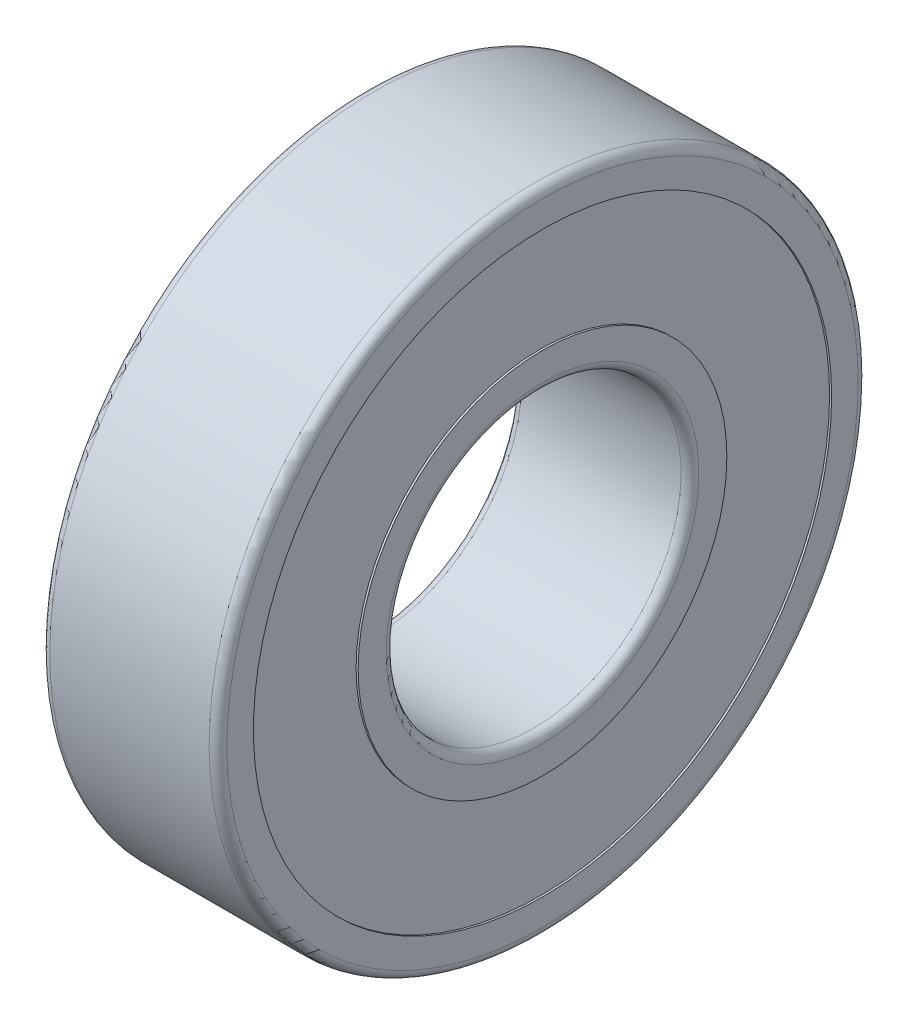
ISO-10303-21;
HEADER;
FILE_DESCRIPTION(('STEP AP214'),'2;1');
FILE_NAME('part.step','',(''),(''),'','','');
FILE_SCHEMA(('AUTOMOTIVE_DESIGN { 1 0 10303 214 1 1 1 1 }'));
ENDSEC;
DATA;
#1=APPLICATION_CONTEXT('core data for automotive mechanical design processes');
#2=APPLICATION_PROTOCOL_DEFINITION('international standard','automotive_design',2000,#1);
#3=PRODUCT_CONTEXT('',#1,'mechanical');
#4=PRODUCT('Part','Part','',(#3));
#5=PRODUCT_RELATED_PRODUCT_CATEGORY('part','',(#4));
#6=PRODUCT_DEFINITION_FORMATION('','',#4);
#7=PRODUCT_DEFINITION_CONTEXT('part definition',#1,'design');
#8=PRODUCT_DEFINITION('design','',#6,#7);
#9=PRODUCT_DEFINITION_SHAPE('','',#8);
#10=(LENGTH_UNIT() NAMED_UNIT(*) SI_UNIT(.MILLI.,.METRE.));
#11=(NAMED_UNIT(*) PLANE_ANGLE_UNIT() SI_UNIT($,.RADIAN.));
#12=(NAMED_UNIT(*) SI_UNIT($,.STERADIAN.) SOLID_ANGLE_UNIT());
#13=UNCERTAINTY_MEASURE_WITH_UNIT(LENGTH_MEASURE(1.E-05),#10,'distance_accuracy_value','');
#14=(GEOMETRIC_REPRESENTATION_CONTEXT(3) GLOBAL_UNCERTAINTY_ASSIGNED_CONTEXT((#13)) GLOBAL_UNIT_ASSIGNED_CONTEXT((#10,
#11,#12)) REPRESENTATION_CONTEXT('',''));
#15=CARTESIAN_POINT('',(0.,0.,0.));
#16=DIRECTION('',(0.,0.,1.));
#17=DIRECTION('',(1.,0.,0.));
#18=AXIS2_PLACEMENT_3D('',#15,#16,#17);
#19=CARTESIAN_POINT('',(3.,-3.71778537635,-7.083648205226));
#20=DIRECTION('',(-1.,0.,0.));
#21=DIRECTION('',(0.,0.,-1.));
#22=AXIS2_PLACEMENT_3D('',#19,#20,#21);
#23=SPHERICAL_SURFACE('',#22,1.5);
#24=CARTESIAN_POINT('',(4.5,-3.71778537635,-7.083648205226));
#25=VERTEX_POINT('',#24);
#26=VERTEX_LOOP('',#25);
#27=FACE_BOUND('',#26,.T.);
#28=ADVANCED_FACE('P0_F15',(#27),#23,.T.);
#29=CLOSED_SHELL('',(#28));
#30=MANIFOLD_SOLID_BREP('P0_B1',#29);
#31=CARTESIAN_POINT('',(3.,7.941670992784,-0.964293442043));
#32=DIRECTION('',(-1.,0.,0.));
#33=DIRECTION('',(0.,0.,-1.));
#34=AXIS2_PLACEMENT_3D('',#31,#32,#33);
#35=SPHERICAL_SURFACE('',#34,1.5);
#36=CARTESIAN_POINT('',(4.5,7.941670992784,-0.964293442043));
#37=VERTEX_POINT('',#36);
#38=VERTEX_LOOP('',#37);
#39=FACE_BOUND('',#38,.T.);
#40=ADVANCED_FACE('P1_F15',(#39),#35,.T.);
#41=CLOSED_SHELL('',(#40));
#42=MANIFOLD_SOLID_BREP('P1_B1',#41);
#43=CARTESIAN_POINT('',(3.,6.583870927149,-4.544517973849));
#44=DIRECTION('',(-1.,0.,0.));
#45=DIRECTION('',(0.,0.,-1.));
#46=AXIS2_PLACEMENT_3D('',#43,#44,#45);
#47=SPHERICAL_SURFACE('',#46,1.5);
#48=CARTESIAN_POINT('',(4.5,6.583870927149,-4.544517973849));
#49=VERTEX_POINT('',#48);
#50=VERTEX_LOOP('',#49);
#51=FACE_BOUND('',#50,.T.);
#52=ADVANCED_FACE('P2_F15',(#51),#47,.T.);
#53=CLOSED_SHELL('',(#52));
#54=MANIFOLD_SOLID_BREP('P2_B1',#53);
#55=CARTESIAN_POINT('',(3.,3.71778537635,-7.083648205226));
#56=DIRECTION('',(-1.,0.,0.));
#57=DIRECTION('',(0.,0.,-1.));
#58=AXIS2_PLACEMENT_3D('',#55,#56,#57);
#59=SPHERICAL_SURFACE('',#58,1.5);
#60=CARTESIAN_POINT('',(4.5,3.71778537635,-7.083648205226));
#61=VERTEX_POINT('',#60);
#62=VERTEX_LOOP('',#61);
#63=FACE_BOUND('',#62,.T.);
#64=ADVANCED_FACE('P3_F15',(#63),#59,.T.);
#65=CLOSED_SHELL('',(#64));
#66=MANIFOLD_SOLID_BREP('P3_B1',#65);
#67=CARTESIAN_POINT('',(3.,0.,-8.));
#68=DIRECTION('',(-1.,0.,0.));
#69=DIRECTION('',(0.,0.,-1.));
#70=AXIS2_PLACEMENT_3D('',#67,#68,#69);
#71=SPHERICAL_SURFACE('',#70,1.5);
#72=CARTESIAN_POINT('',(4.5,0.,-8.));
#73=VERTEX_POINT('',#72);
#74=VERTEX_LOOP('',#73);
#75=FACE_BOUND('',#74,.T.);
#76=ADVANCED_FACE('P4_F15',(#75),#71,.T.);
#77=CLOSED_SHELL('',(#76));
#78=MANIFOLD_SOLID_BREP('P4_B1',#77);
#79=CARTESIAN_POINT('',(3.,-6.583870927149,-4.544517973849));
#80=DIRECTION('',(-1.,0.,0.));
#81=DIRECTION('',(0.,0.,-1.));
#82=AXIS2_PLACEMENT_3D('',#79,#80,#81);
#83=SPHERICAL_SURFACE('',#82,1.5);
#84=CARTESIAN_POINT('',(4.5,-6.583870927149,-4.544517973849));
#85=VERTEX_POINT('',#84);
#86=VERTEX_LOOP('',#85);
#87=FACE_BOUND('',#86,.T.);
#88=ADVANCED_FACE('P5_F15',(#87),#83,.T.);
#89=CLOSED_SHELL('',(#88));
#90=MANIFOLD_SOLID_BREP('P5_B1',#89);
#91=CARTESIAN_POINT('',(3.,-7.941670992784,-0.964293442043));
#92=DIRECTION('',(-1.,0.,0.));
#93=DIRECTION('',(0.,0.,-1.));
#94=AXIS2_PLACEMENT_3D('',#91,#92,#93);
#95=SPHERICAL_SURFACE('',#94,1.5);
#96=CARTESIAN_POINT('',(4.5,-7.941670992784,-0.964293442043));
#97=VERTEX_POINT('',#96);
#98=VERTEX_LOOP('',#97);
#99=FACE_BOUND('',#98,.T.);
#100=ADVANCED_FACE('P6_F15',(#99),#95,.T.);
#101=CLOSED_SHELL('',(#100));
#102=MANIFOLD_SOLID_BREP('P6_B1',#101);
#103=CARTESIAN_POINT('',(3.,-7.480129941483,2.83683909634));
#104=DIRECTION('',(-1.,0.,0.));
#105=DIRECTION('',(0.,0.,-1.));
#106=AXIS2_PLACEMENT_3D('',#103,#104,#105);
#107=SPHERICAL_SURFACE('',#106,1.5);
#108=CARTESIAN_POINT('',(4.5,-7.480129941483,2.83683909634));
#109=VERTEX_POINT('',#108);
#110=VERTEX_LOOP('',#109);
#111=FACE_BOUND('',#110,.T.);
#112=ADVANCED_FACE('P7_F15',(#111),#107,.T.);
#113=CLOSED_SHELL('',(#112));
#114=MANIFOLD_SOLID_BREP('P7_B1',#113);
#115=CARTESIAN_POINT('',(3.,-5.304981265926,5.988085985369));
#116=DIRECTION('',(-1.,0.,0.));
#117=DIRECTION('',(0.,0.,-1.));
#118=AXIS2_PLACEMENT_3D('',#115,#116,#117);
#119=SPHERICAL_SURFACE('',#118,1.5);
#120=CARTESIAN_POINT('',(4.5,-5.304981265926,5.988085985369));
#121=VERTEX_POINT('',#120);
#122=VERTEX_LOOP('',#121);
#123=FACE_BOUND('',#122,.T.);
#124=ADVANCED_FACE('P8_F15',(#123),#119,.T.);
#125=CLOSED_SHELL('',(#124));
#126=MANIFOLD_SOLID_BREP('P8_B1',#125);
#127=CARTESIAN_POINT('',(3.,-1.9145253143,7.767534539408));
#128=DIRECTION('',(-1.,0.,0.));
#129=DIRECTION('',(0.,0.,-1.));
#130=AXIS2_PLACEMENT_3D('',#127,#128,#129);
#131=SPHERICAL_SURFACE('',#130,1.5);
#132=CARTESIAN_POINT('',(4.5,-1.9145253143,7.767534539408));
#133=VERTEX_POINT('',#132);
#134=VERTEX_LOOP('',#133);
#135=FACE_BOUND('',#134,.T.);
#136=ADVANCED_FACE('P9_F15',(#135),#131,.T.);
#137=CLOSED_SHELL('',(#136));
#138=MANIFOLD_SOLID_BREP('P9_B1',#137);
#139=CARTESIAN_POINT('',(3.,1.9145253143,7.767534539408));
#140=DIRECTION('',(-1.,0.,0.));
#141=DIRECTION('',(0.,0.,-1.));
#142=AXIS2_PLACEMENT_3D('',#139,#140,#141);
#143=SPHERICAL_SURFACE('',#142,1.5);
#144=CARTESIAN_POINT('',(4.5,1.9145253143,7.767534539408));
#145=VERTEX_POINT('',#144);
#146=VERTEX_LOOP('',#145);
#147=FACE_BOUND('',#146,.T.);
#148=ADVANCED_FACE('P10_F15',(#147),#143,.T.);
#149=CLOSED_SHELL('',(#148));
#150=MANIFOLD_SOLID_BREP('P10_B1',#149);
#151=CARTESIAN_POINT('',(3.,5.304981265926,5.988085985369));
#152=DIRECTION('',(-1.,0.,0.));
#153=DIRECTION('',(0.,0.,-1.));
#154=AXIS2_PLACEMENT_3D('',#151,#152,#153);
#155=SPHERICAL_SURFACE('',#154,1.5);
#156=CARTESIAN_POINT('',(4.5,5.304981265926,5.988085985369));
#157=VERTEX_POINT('',#156);
#158=VERTEX_LOOP('',#157);
#159=FACE_BOUND('',#158,.T.);
#160=ADVANCED_FACE('P11_F15',(#159),#155,.T.);
#161=CLOSED_SHELL('',(#160));
#162=MANIFOLD_SOLID_BREP('P11_B1',#161);
#163=CARTESIAN_POINT('',(3.,7.480129941483,2.83683909634));
#164=DIRECTION('',(-1.,0.,0.));
#165=DIRECTION('',(0.,0.,-1.));
#166=AXIS2_PLACEMENT_3D('',#163,#164,#165);
#167=SPHERICAL_SURFACE('',#166,1.5);
#168=CARTESIAN_POINT('',(4.5,7.480129941483,2.83683909634));
#169=VERTEX_POINT('',#168);
#170=VERTEX_LOOP('',#169);
#171=FACE_BOUND('',#170,.T.);
#172=ADVANCED_FACE('P12_F15',(#171),#167,.T.);
#173=CLOSED_SHELL('',(#172));
#174=MANIFOLD_SOLID_BREP('P12_B1',#173);
#175=CARTESIAN_POINT('',(6.,0.,0.));
#176=DIRECTION('',(1.,0.,0.));
#177=DIRECTION('',(0.,-1.,0.));
#178=AXIS2_PLACEMENT_3D('',#175,#176,#177);
#179=CYLINDRICAL_SURFACE('',#178,6.25);
#180=CARTESIAN_POINT('',(0.276,0.,0.));
#181=DIRECTION('',(1.,0.,0.));
#182=DIRECTION('',(0.,-1.,0.));
#183=AXIS2_PLACEMENT_3D('',#180,#181,#182);
#184=CIRCLE('',#183,6.25);
#185=CARTESIAN_POINT('',(0.276,-6.25,0.));
#186=VERTEX_POINT('',#185);
#187=EDGE_CURVE('P13_E11',#186,#186,#184,.T.);
#188=ORIENTED_EDGE('',*,*,#187,.F.);
#189=EDGE_LOOP('',(#188));
#190=FACE_BOUND('',#189,.T.);
#191=CARTESIAN_POINT('',(0.,0.,0.));
#192=DIRECTION('',(1.,0.,0.));
#193=DIRECTION('',(0.,-1.,0.));
#194=AXIS2_PLACEMENT_3D('',#191,#192,#193);
#195=CIRCLE('',#194,6.25);
#196=CARTESIAN_POINT('',(0.,-6.25,0.));
#197=VERTEX_POINT('',#196);
#198=EDGE_CURVE('P13_E70',#197,#197,#195,.T.);
#199=ORIENTED_EDGE('',*,*,#198,.T.);
#200=EDGE_LOOP('',(#199));
#201=FACE_BOUND('',#200,.T.);
#202=ADVANCED_FACE('P13_F17',(#190,#201),#179,.T.);
#203=CARTESIAN_POINT('',(0.276,0.,-6.855));
#204=DIRECTION('',(-1.,0.,0.));
#205=DIRECTION('',(0.,1.,0.));
#206=AXIS2_PLACEMENT_3D('',#203,#204,#205);
#207=PLANE('',#206);
#208=CARTESIAN_POINT('',(0.276,0.,0.));
#209=DIRECTION('',(1.,0.,0.));
#210=DIRECTION('',(0.,-1.,0.));
#211=AXIS2_PLACEMENT_3D('',#208,#209,#210);
#212=CIRCLE('',#211,6.855);
#213=CARTESIAN_POINT('',(0.276,-6.855,0.));
#214=VERTEX_POINT('',#213);
#215=EDGE_CURVE('P13_E28',#214,#214,#212,.T.);
#216=ORIENTED_EDGE('',*,*,#215,.F.);
#217=EDGE_LOOP('',(#216));
#218=FACE_BOUND('',#217,.T.);
#219=ORIENTED_EDGE('',*,*,#187,.T.);
#220=EDGE_LOOP('',(#219));
#221=FACE_BOUND('',#220,.T.);
#222=ADVANCED_FACE('P13_F186',(#218,#221),#207,.T.);
#223=CARTESIAN_POINT('',(6.,0.,0.));
#224=DIRECTION('',(1.,0.,0.));
#225=DIRECTION('',(0.,-1.,0.));
#226=AXIS2_PLACEMENT_3D('',#223,#224,#225);
#227=CYLINDRICAL_SURFACE('',#226,6.855);
#228=CARTESIAN_POINT('',(2.03099277608472,0.,0.));
#229=DIRECTION('',(1.,0.,0.));
#230=DIRECTION('',(0.,-1.,0.));
#231=AXIS2_PLACEMENT_3D('',#228,#229,#230);
#232=CIRCLE('',#231,6.855);
#233=CARTESIAN_POINT('',(2.03099277608472,-6.855,0.));
#234=VERTEX_POINT('',#233);
#235=EDGE_CURVE('P13_E100',#234,#234,#232,.T.);
#236=ORIENTED_EDGE('',*,*,#235,.F.);
#237=EDGE_LOOP('',(#236));
#238=FACE_BOUND('',#237,.T.);
#239=ORIENTED_EDGE('',*,*,#215,.T.);
#240=EDGE_LOOP('',(#239));
#241=FACE_BOUND('',#240,.T.);
#242=ADVANCED_FACE('P13_F19',(#238,#241),#227,.T.);
#243=CARTESIAN_POINT('',(3.,0.,0.));
#244=DIRECTION('',(1.,0.,0.));
#245=DIRECTION('',(0.,-1.,0.));
#246=AXIS2_PLACEMENT_3D('',#243,#244,#245);
#247=TOROIDAL_SURFACE('',#246,8.,1.5);
#248=ORIENTED_EDGE('',*,*,#235,.T.);
#249=EDGE_LOOP('',(#248));
#250=FACE_BOUND('',#249,.T.);
#251=CARTESIAN_POINT('',(3.96900722391528,0.,0.));
#252=DIRECTION('',(1.,0.,0.));
#253=DIRECTION('',(0.,-1.,0.));
#254=AXIS2_PLACEMENT_3D('',#251,#252,#253);
#255=CIRCLE('',#254,6.855);
#256=CARTESIAN_POINT('',(3.96900722391528,-6.855,0.));
#257=VERTEX_POINT('',#256);
#258=EDGE_CURVE('P13_E21',#257,#257,#255,.T.);
#259=ORIENTED_EDGE('',*,*,#258,.F.);
#260=EDGE_LOOP('',(#259));
#261=FACE_BOUND('',#260,.T.);
#262=ADVANCED_FACE('P13_F230',(#250,#261),#247,.F.);
#263=CARTESIAN_POINT('',(6.,0.,0.));
#264=DIRECTION('',(1.,0.,0.));
#265=DIRECTION('',(0.,-1.,0.));
#266=AXIS2_PLACEMENT_3D('',#263,#264,#265);
#267=CYLINDRICAL_SURFACE('',#266,6.855);
#268=CARTESIAN_POINT('',(5.724,0.,0.));
#269=DIRECTION('',(1.,0.,0.));
#270=DIRECTION('',(0.,-1.,0.));
#271=AXIS2_PLACEMENT_3D('',#268,#269,#270);
#272=CIRCLE('',#271,6.855);
#273=CARTESIAN_POINT('',(5.724,-6.855,0.));
#274=VERTEX_POINT('',#273);
#275=EDGE_CURVE('P13_E92',#274,#274,#272,.T.);
#276=ORIENTED_EDGE('',*,*,#275,.F.);
#277=EDGE_LOOP('',(#276));
#278=FACE_BOUND('',#277,.T.);
#279=ORIENTED_EDGE('',*,*,#258,.T.);
#280=EDGE_LOOP('',(#279));
#281=FACE_BOUND('',#280,.T.);
#282=ADVANCED_FACE('P13_F97',(#278,#281),#267,.T.);
#283=CARTESIAN_POINT('',(5.724,0.,-6.25));
#284=DIRECTION('',(1.,0.,0.));
#285=DIRECTION('',(0.,0.,-1.));
#286=AXIS2_PLACEMENT_3D('',#283,#284,#285);
#287=PLANE('',#286);
#288=CARTESIAN_POINT('',(5.724,0.,0.));
#289=DIRECTION('',(1.,0.,0.));
#290=DIRECTION('',(0.,-1.,0.));
#291=AXIS2_PLACEMENT_3D('',#288,#289,#290);
#292=CIRCLE('',#291,6.25);
#293=CARTESIAN_POINT('',(5.724,-6.25,0.));
#294=VERTEX_POINT('',#293);
#295=EDGE_CURVE('P13_E107',#294,#294,#292,.T.);
#296=ORIENTED_EDGE('',*,*,#295,.F.);
#297=EDGE_LOOP('',(#296));
#298=FACE_BOUND('',#297,.T.);
#299=ORIENTED_EDGE('',*,*,#275,.T.);
#300=EDGE_LOOP('',(#299));
#301=FACE_BOUND('',#300,.T.);
#302=ADVANCED_FACE('P13_F152',(#298,#301),#287,.T.);
#303=CARTESIAN_POINT('',(6.,0.,0.));
#304=DIRECTION('',(1.,0.,0.));
#305=DIRECTION('',(0.,-1.,0.));
#306=AXIS2_PLACEMENT_3D('',#303,#304,#305);
#307=CYLINDRICAL_SURFACE('',#306,6.25);
#308=CARTESIAN_POINT('',(6.,0.,0.));
#309=DIRECTION('',(1.,0.,0.));
#310=DIRECTION('',(0.,-1.,0.));
#311=AXIS2_PLACEMENT_3D('',#308,#309,#310);
#312=CIRCLE('',#311,6.25);
#313=CARTESIAN_POINT('',(6.,-6.25,0.));
#314=VERTEX_POINT('',#313);
#315=EDGE_CURVE('P13_E112',#314,#314,#312,.T.);
#316=ORIENTED_EDGE('',*,*,#315,.F.);
#317=EDGE_LOOP('',(#316));
#318=FACE_BOUND('',#317,.T.);
#319=ORIENTED_EDGE('',*,*,#295,.T.);
#320=EDGE_LOOP('',(#319));
#321=FACE_BOUND('',#320,.T.);
#322=ADVANCED_FACE('P13_F157',(#318,#321),#307,.T.);
#323=CARTESIAN_POINT('',(6.,0.,-5.3));
#324=DIRECTION('',(1.,0.,0.));
#325=DIRECTION('',(0.,0.,-1.));
#326=AXIS2_PLACEMENT_3D('',#323,#324,#325);
#327=PLANE('',#326);
#328=CARTESIAN_POINT('',(6.,0.,0.));
#329=DIRECTION('',(1.,0.,0.));
#330=DIRECTION('',(0.,-1.,0.));
#331=AXIS2_PLACEMENT_3D('',#328,#329,#330);
#332=CIRCLE('',#331,5.3);
#333=CARTESIAN_POINT('',(6.,-5.3,0.));
#334=VERTEX_POINT('',#333);
#335=EDGE_CURVE('P13_E120',#334,#334,#332,.T.);
#336=ORIENTED_EDGE('',*,*,#335,.F.);
#337=EDGE_LOOP('',(#336));
#338=FACE_BOUND('',#337,.T.);
#339=ORIENTED_EDGE('',*,*,#315,.T.);
#340=EDGE_LOOP('',(#339));
#341=FACE_BOUND('',#340,.T.);
#342=ADVANCED_FACE('P13_F200',(#338,#341),#327,.T.);
#343=CARTESIAN_POINT('',(5.7,0.,0.));
#344=DIRECTION('',(1.,0.,0.));
#345=DIRECTION('',(0.,-1.,0.));
#346=AXIS2_PLACEMENT_3D('',#343,#344,#345);
#347=TOROIDAL_SURFACE('',#346,5.3,0.3);
#348=CARTESIAN_POINT('',(5.7,0.,0.));
#349=DIRECTION('',(1.,0.,0.));
#350=DIRECTION('',(0.,-1.,0.));
#351=AXIS2_PLACEMENT_3D('',#348,#349,#350);
#352=CIRCLE('',#351,5.);
#353=CARTESIAN_POINT('',(5.7,-5.,0.));
#354=VERTEX_POINT('',#353);
#355=EDGE_CURVE('P13_E119',#354,#354,#352,.T.);
#356=ORIENTED_EDGE('',*,*,#355,.F.);
#357=EDGE_LOOP('',(#356));
#358=FACE_BOUND('',#357,.T.);
#359=ORIENTED_EDGE('',*,*,#335,.T.);
#360=EDGE_LOOP('',(#359));
#361=FACE_BOUND('',#360,.T.);
#362=ADVANCED_FACE('P13_F180',(#358,#361),#347,.T.);
#363=CARTESIAN_POINT('',(6.,0.,0.));
#364=DIRECTION('',(1.,0.,0.));
#365=DIRECTION('',(0.,-1.,0.));
#366=AXIS2_PLACEMENT_3D('',#363,#364,#365);
#367=CYLINDRICAL_SURFACE('',#366,5.);
#368=CARTESIAN_POINT('',(0.3,0.,0.));
#369=DIRECTION('',(1.,0.,0.));
#370=DIRECTION('',(0.,-1.,0.));
#371=AXIS2_PLACEMENT_3D('',#368,#369,#370);
#372=CIRCLE('',#371,5.);
#373=CARTESIAN_POINT('',(0.3,-5.,0.));
#374=VERTEX_POINT('',#373);
#375=EDGE_CURVE('P13_E59',#374,#374,#372,.T.);
#376=ORIENTED_EDGE('',*,*,#375,.F.);
#377=EDGE_LOOP('',(#376));
#378=FACE_BOUND('',#377,.T.);
#379=ORIENTED_EDGE('',*,*,#355,.T.);
#380=EDGE_LOOP('',(#379));
#381=FACE_BOUND('',#380,.T.);
#382=ADVANCED_FACE('P13_F170',(#378,#381),#367,.F.);
#383=CARTESIAN_POINT('',(0.3,0.,0.));
#384=DIRECTION('',(1.,0.,0.));
#385=DIRECTION('',(0.,-1.,0.));
#386=AXIS2_PLACEMENT_3D('',#383,#384,#385);
#387=TOROIDAL_SURFACE('',#386,5.3,0.3);
#388=CARTESIAN_POINT('',(0.,0.,0.));
#389=DIRECTION('',(1.,0.,0.));
#390=DIRECTION('',(0.,-1.,0.));
#391=AXIS2_PLACEMENT_3D('',#388,#389,#390);
#392=CIRCLE('',#391,5.3);
#393=CARTESIAN_POINT('',(0.,-5.3,0.));
#394=VERTEX_POINT('',#393);
#395=EDGE_CURVE('P13_E78',#394,#394,#392,.T.);
#396=ORIENTED_EDGE('',*,*,#395,.F.);
#397=EDGE_LOOP('',(#396));
#398=FACE_BOUND('',#397,.T.);
#399=ORIENTED_EDGE('',*,*,#375,.T.);
#400=EDGE_LOOP('',(#399));
#401=FACE_BOUND('',#400,.T.);
#402=ADVANCED_FACE('P13_F164',(#398,#401),#387,.T.);
#403=CARTESIAN_POINT('',(0.,0.,-6.25));
#404=DIRECTION('',(-1.,0.,0.));
#405=DIRECTION('',(0.,1.,0.));
#406=AXIS2_PLACEMENT_3D('',#403,#404,#405);
#407=PLANE('',#406);
#408=ORIENTED_EDGE('',*,*,#198,.F.);
#409=EDGE_LOOP('',(#408));
#410=FACE_BOUND('',#409,.T.);
#411=ORIENTED_EDGE('',*,*,#395,.T.);
#412=EDGE_LOOP('',(#411));
#413=FACE_BOUND('',#412,.T.);
#414=ADVANCED_FACE('P13_F169',(#410,#413),#407,.T.);
#415=CLOSED_SHELL('',(#202,#222,#242,#262,#282,#302,#322,#342,#362,#382,#402,#414));
#416=MANIFOLD_SOLID_BREP('P13_B1',#415);
#417=CARTESIAN_POINT('',(0.3,0.,0.));
#418=DIRECTION('',(1.,0.,0.));
#419=DIRECTION('',(0.,0.,-1.));
#420=AXIS2_PLACEMENT_3D('',#417,#418,#419);
#421=TOROIDAL_SURFACE('',#420,10.7,0.3);
#422=CARTESIAN_POINT('',(0.3,0.,0.));
#423=DIRECTION('',(1.,0.,0.));
#424=DIRECTION('',(0.,0.,-1.));
#425=AXIS2_PLACEMENT_3D('',#422,#423,#424);
#426=CIRCLE('',#425,11.);
#427=CARTESIAN_POINT('',(0.3,0.,-11.));
#428=VERTEX_POINT('',#427);
#429=EDGE_CURVE('P14_E10',#428,#428,#426,.T.);
#430=ORIENTED_EDGE('',*,*,#429,.F.);
#431=EDGE_LOOP('',(#430));
#432=FACE_BOUND('',#431,.T.);
#433=CARTESIAN_POINT('',(0.,0.,0.));
#434=DIRECTION('',(1.,0.,0.));
#435=DIRECTION('',(0.,0.,-1.));
#436=AXIS2_PLACEMENT_3D('',#433,#434,#435);
#437=CIRCLE('',#436,10.7);
#438=CARTESIAN_POINT('',(0.,0.,-10.7));
#439=VERTEX_POINT('',#438);
#440=EDGE_CURVE('P14_E106',#439,#439,#437,.T.);
#441=ORIENTED_EDGE('',*,*,#440,.T.);
#442=EDGE_LOOP('',(#441));
#443=FACE_BOUND('',#442,.T.);
#444=ADVANCED_FACE('P14_F16',(#432,#443),#421,.T.);
#445=CARTESIAN_POINT('',(6.,0.,0.));
#446=DIRECTION('',(1.,0.,0.));
#447=DIRECTION('',(0.,0.,-1.));
#448=AXIS2_PLACEMENT_3D('',#445,#446,#447);
#449=CYLINDRICAL_SURFACE('',#448,11.);
#450=CARTESIAN_POINT('',(5.7,0.,0.));
#451=DIRECTION('',(1.,0.,0.));
#452=DIRECTION('',(0.,0.,-1.));
#453=AXIS2_PLACEMENT_3D('',#450,#451,#452);
#454=CIRCLE('',#453,11.);
#455=CARTESIAN_POINT('',(5.7,0.,-11.));
#456=VERTEX_POINT('',#455);
#457=EDGE_CURVE('P14_E26',#456,#456,#454,.T.);
#458=ORIENTED_EDGE('',*,*,#457,.F.);
#459=EDGE_LOOP('',(#458));
#460=FACE_BOUND('',#459,.T.);
#461=ORIENTED_EDGE('',*,*,#429,.T.);
#462=EDGE_LOOP('',(#461));
#463=FACE_BOUND('',#462,.T.);
#464=ADVANCED_FACE('P14_F251',(#460,#463),#449,.T.);
#465=CARTESIAN_POINT('',(5.7,0.,0.));
#466=DIRECTION('',(1.,0.,0.));
#467=DIRECTION('',(0.,0.,-1.));
#468=AXIS2_PLACEMENT_3D('',#465,#466,#467);
#469=TOROIDAL_SURFACE('',#468,10.7,0.3);
#470=CARTESIAN_POINT('',(6.,0.,0.));
#471=DIRECTION('',(1.,0.,0.));
#472=DIRECTION('',(0.,0.,-1.));
#473=AXIS2_PLACEMENT_3D('',#470,#471,#472);
#474=CIRCLE('',#473,10.7);
#475=CARTESIAN_POINT('',(6.,0.,-10.7));
#476=VERTEX_POINT('',#475);
#477=EDGE_CURVE('P14_E88',#476,#476,#474,.T.);
#478=ORIENTED_EDGE('',*,*,#477,.F.);
#479=EDGE_LOOP('',(#478));
#480=FACE_BOUND('',#479,.T.);
#481=ORIENTED_EDGE('',*,*,#457,.T.);
#482=EDGE_LOOP('',(#481));
#483=FACE_BOUND('',#482,.T.);
#484=ADVANCED_FACE('P14_F243',(#480,#483),#469,.T.);
#485=CARTESIAN_POINT('',(6.,9.8,0.));
#486=DIRECTION('',(1.,0.,0.));
#487=DIRECTION('',(0.,1.,0.));
#488=AXIS2_PLACEMENT_3D('',#485,#486,#487);
#489=PLANE('',#488);
#490=CARTESIAN_POINT('',(6.,0.,0.));
#491=DIRECTION('',(1.,0.,0.));
#492=DIRECTION('',(0.,0.,-1.));
#493=AXIS2_PLACEMENT_3D('',#490,#491,#492);
#494=CIRCLE('',#493,9.8);
#495=CARTESIAN_POINT('',(6.,0.,-9.8));
#496=VERTEX_POINT('',#495);
#497=EDGE_CURVE('P14_E84',#496,#496,#494,.T.);
#498=ORIENTED_EDGE('',*,*,#497,.F.);
#499=EDGE_LOOP('',(#498));
#500=FACE_BOUND('',#499,.T.);
#501=ORIENTED_EDGE('',*,*,#477,.T.);
#502=EDGE_LOOP('',(#501));
#503=FACE_BOUND('',#502,.T.);
#504=ADVANCED_FACE('P14_F233',(#500,#503),#489,.T.);
#505=CARTESIAN_POINT('',(6.,0.,0.));
#506=DIRECTION('',(1.,0.,0.));
#507=DIRECTION('',(0.,0.,-1.));
#508=AXIS2_PLACEMENT_3D('',#505,#506,#507);
#509=CYLINDRICAL_SURFACE('',#508,9.8);
#510=CARTESIAN_POINT('',(5.724,0.,0.));
#511=DIRECTION('',(1.,0.,0.));
#512=DIRECTION('',(0.,0.,-1.));
#513=AXIS2_PLACEMENT_3D('',#510,#511,#512);
#514=CIRCLE('',#513,9.8);
#515=CARTESIAN_POINT('',(5.724,0.,-9.8));
#516=VERTEX_POINT('',#515);
#517=EDGE_CURVE('P14_E89',#516,#516,#514,.T.);
#518=ORIENTED_EDGE('',*,*,#517,.F.);
#519=EDGE_LOOP('',(#518));
#520=FACE_BOUND('',#519,.T.);
#521=ORIENTED_EDGE('',*,*,#497,.T.);
#522=EDGE_LOOP('',(#521));
#523=FACE_BOUND('',#522,.T.);
#524=ADVANCED_FACE('P14_F85',(#520,#523),#509,.F.);
#525=CARTESIAN_POINT('',(5.724,9.175,0.));
#526=DIRECTION('',(1.,0.,0.));
#527=DIRECTION('',(0.,1.,0.));
#528=AXIS2_PLACEMENT_3D('',#525,#526,#527);
#529=PLANE('',#528);
#530=CARTESIAN_POINT('',(5.724,0.,0.));
#531=DIRECTION('',(1.,0.,0.));
#532=DIRECTION('',(0.,0.,-1.));
#533=AXIS2_PLACEMENT_3D('',#530,#531,#532);
#534=CIRCLE('',#533,9.175);
#535=CARTESIAN_POINT('',(5.724,0.,-9.175));
#536=VERTEX_POINT('',#535);
#537=EDGE_CURVE('P14_E96',#536,#536,#534,.T.);
#538=ORIENTED_EDGE('',*,*,#537,.F.);
#539=EDGE_LOOP('',(#538));
#540=FACE_BOUND('',#539,.T.);
#541=ORIENTED_EDGE('',*,*,#517,.T.);
#542=EDGE_LOOP('',(#541));
#543=FACE_BOUND('',#542,.T.);
#544=ADVANCED_FACE('P14_F216',(#540,#543),#529,.T.);
#545=CARTESIAN_POINT('',(6.,0.,0.));
#546=DIRECTION('',(1.,0.,0.));
#547=DIRECTION('',(0.,0.,-1.));
#548=AXIS2_PLACEMENT_3D('',#545,#546,#547);
#549=CYLINDRICAL_SURFACE('',#548,9.175);
#550=CARTESIAN_POINT('',(3.93240280994858,0.,0.));
#551=DIRECTION('',(1.,0.,0.));
#552=DIRECTION('',(0.,0.,-1.));
#553=AXIS2_PLACEMENT_3D('',#550,#551,#552);
#554=CIRCLE('',#553,9.175);
#555=CARTESIAN_POINT('',(3.93240280994858,0.,-9.175));
#556=VERTEX_POINT('',#555);
#557=EDGE_CURVE('P14_E101',#556,#556,#554,.T.);
#558=ORIENTED_EDGE('',*,*,#557,.F.);
#559=EDGE_LOOP('',(#558));
#560=FACE_BOUND('',#559,.T.);
#561=ORIENTED_EDGE('',*,*,#537,.T.);
#562=EDGE_LOOP('',(#561));
#563=FACE_BOUND('',#562,.T.);
#564=ADVANCED_FACE('P14_F207',(#560,#563),#549,.F.);
#565=CARTESIAN_POINT('',(3.,0.,0.));
#566=DIRECTION('',(1.,0.,0.));
#567=DIRECTION('',(0.,0.,-1.));
#568=AXIS2_PLACEMENT_3D('',#565,#566,#567);
#569=TOROIDAL_SURFACE('',#568,8.,1.5);
#570=ORIENTED_EDGE('',*,*,#557,.T.);
#571=EDGE_LOOP('',(#570));
#572=FACE_BOUND('',#571,.T.);
#573=CARTESIAN_POINT('',(2.06759719005142,0.,0.));
#574=DIRECTION('',(1.,0.,0.));
#575=DIRECTION('',(0.,0.,-1.));
#576=AXIS2_PLACEMENT_3D('',#573,#574,#575);
#577=CIRCLE('',#576,9.175);
#578=CARTESIAN_POINT('',(2.06759719005142,0.,-9.175));
#579=VERTEX_POINT('',#578);
#580=EDGE_CURVE('P14_E20',#579,#579,#577,.T.);
#581=ORIENTED_EDGE('',*,*,#580,.F.);
#582=EDGE_LOOP('',(#581));
#583=FACE_BOUND('',#582,.T.);
#584=ADVANCED_FACE('P14_F136',(#572,#583),#569,.F.);
#585=CARTESIAN_POINT('',(6.,0.,0.));
#586=DIRECTION('',(1.,0.,0.));
#587=DIRECTION('',(0.,0.,-1.));
#588=AXIS2_PLACEMENT_3D('',#585,#586,#587);
#589=CYLINDRICAL_SURFACE('',#588,9.175);
#590=CARTESIAN_POINT('',(0.276,0.,0.));
#591=DIRECTION('',(1.,0.,0.));
#592=DIRECTION('',(0.,0.,-1.));
#593=AXIS2_PLACEMENT_3D('',#590,#591,#592);
#594=CIRCLE('',#593,9.175);
#595=CARTESIAN_POINT('',(0.276,0.,-9.175));
#596=VERTEX_POINT('',#595);
#597=EDGE_CURVE('P14_E105',#596,#596,#594,.T.);
#598=ORIENTED_EDGE('',*,*,#597,.F.);
#599=EDGE_LOOP('',(#598));
#600=FACE_BOUND('',#599,.T.);
#601=ORIENTED_EDGE('',*,*,#580,.T.);
#602=EDGE_LOOP('',(#601));
#603=FACE_BOUND('',#602,.T.);
#604=ADVANCED_FACE('P14_F130',(#600,#603),#589,.F.);
#605=CARTESIAN_POINT('',(0.276,9.8,0.));
#606=DIRECTION('',(-1.,0.,0.));
#607=DIRECTION('',(0.,0.,1.));
#608=AXIS2_PLACEMENT_3D('',#605,#606,#607);
#609=PLANE('',#608);
#610=CARTESIAN_POINT('',(0.276,0.,0.));
#611=DIRECTION('',(1.,0.,0.));
#612=DIRECTION('',(0.,0.,-1.));
#613=AXIS2_PLACEMENT_3D('',#610,#611,#612);
#614=CIRCLE('',#613,9.8);
#615=CARTESIAN_POINT('',(0.276,0.,-9.8));
#616=VERTEX_POINT('',#615);
#617=EDGE_CURVE('P14_E102',#616,#616,#614,.T.);
#618=ORIENTED_EDGE('',*,*,#617,.F.);
#619=EDGE_LOOP('',(#618));
#620=FACE_BOUND('',#619,.T.);
#621=ORIENTED_EDGE('',*,*,#597,.T.);
#622=EDGE_LOOP('',(#621));
#623=FACE_BOUND('',#622,.T.);
#624=ADVANCED_FACE('P14_F125',(#620,#623),#609,.T.);
#625=CARTESIAN_POINT('',(6.,0.,0.));
#626=DIRECTION('',(1.,0.,0.));
#627=DIRECTION('',(0.,0.,-1.));
#628=AXIS2_PLACEMENT_3D('',#625,#626,#627);
#629=CYLINDRICAL_SURFACE('',#628,9.8);
#630=CARTESIAN_POINT('',(0.,0.,0.));
#631=DIRECTION('',(1.,0.,0.));
#632=DIRECTION('',(0.,0.,-1.));
#633=AXIS2_PLACEMENT_3D('',#630,#631,#632);
#634=CIRCLE('',#633,9.8);
#635=CARTESIAN_POINT('',(0.,0.,-9.8));
#636=VERTEX_POINT('',#635);
#637=EDGE_CURVE('P14_E114',#636,#636,#634,.T.);
#638=ORIENTED_EDGE('',*,*,#637,.F.);
#639=EDGE_LOOP('',(#638));
#640=FACE_BOUND('',#639,.T.);
#641=ORIENTED_EDGE('',*,*,#617,.T.);
#642=EDGE_LOOP('',(#641));
#643=FACE_BOUND('',#642,.T.);
#644=ADVANCED_FACE('P14_F18',(#640,#643),#629,.F.);
#645=CARTESIAN_POINT('',(0.,10.7,0.));
#646=DIRECTION('',(-1.,0.,0.));
#647=DIRECTION('',(0.,0.,1.));
#648=AXIS2_PLACEMENT_3D('',#645,#646,#647);
#649=PLANE('',#648);
#650=ORIENTED_EDGE('',*,*,#440,.F.);
#651=EDGE_LOOP('',(#650));
#652=FACE_BOUND('',#651,.T.);
#653=ORIENTED_EDGE('',*,*,#637,.T.);
#654=EDGE_LOOP('',(#653));
#655=FACE_BOUND('',#654,.T.);
#656=ADVANCED_FACE('P14_F121',(#652,#655),#649,.T.);
#657=CLOSED_SHELL('',(#444,#464,#484,#504,#524,#544,#564,#584,#604,#624,#644,#656));
#658=MANIFOLD_SOLID_BREP('P14_B1',#657);
#659=CARTESIAN_POINT('',(5.931,0.,0.));
#660=DIRECTION('',(1.,0.,0.));
#661=DIRECTION('',(0.,0.,-1.));
#662=AXIS2_PLACEMENT_3D('',#659,#660,#661);
#663=CYLINDRICAL_SURFACE('',#662,9.8);
#664=CARTESIAN_POINT('',(5.931,0.,0.));
#665=DIRECTION('',(1.,0.,0.));
#666=DIRECTION('',(0.,0.,-1.));
#667=AXIS2_PLACEMENT_3D('',#664,#665,#666);
#668=CIRCLE('',#667,9.8);
#669=CARTESIAN_POINT('',(5.931,0.,-9.8));
#670=VERTEX_POINT('',#669);
#671=EDGE_CURVE('P15_E11',#670,#670,#668,.T.);
#672=ORIENTED_EDGE('',*,*,#671,.F.);
#673=EDGE_LOOP('',(#672));
#674=FACE_BOUND('',#673,.T.);
#675=CARTESIAN_POINT('',(5.724,0.,0.));
#676=DIRECTION('',(1.,0.,0.));
#677=DIRECTION('',(0.,0.,-1.));
#678=AXIS2_PLACEMENT_3D('',#675,#676,#677);
#679=CIRCLE('',#678,9.8);
#680=CARTESIAN_POINT('',(5.724,0.,-9.8));
#681=VERTEX_POINT('',#680);
#682=EDGE_CURVE('P15_E21',#681,#681,#679,.T.);
#683=ORIENTED_EDGE('',*,*,#682,.T.);
#684=EDGE_LOOP('',(#683));
#685=FACE_BOUND('',#684,.T.);
#686=ADVANCED_FACE('P15_F17',(#674,#685),#663,.T.);
#687=CARTESIAN_POINT('',(5.931,6.25,0.));
#688=DIRECTION('',(1.,0.,0.));
#689=DIRECTION('',(0.,1.,0.));
#690=AXIS2_PLACEMENT_3D('',#687,#688,#689);
#691=PLANE('',#690);
#692=CARTESIAN_POINT('',(5.931,0.,0.));
#693=DIRECTION('',(1.,0.,0.));
#694=DIRECTION('',(0.,0.,-1.));
#695=AXIS2_PLACEMENT_3D('',#692,#693,#694);
#696=CIRCLE('',#695,6.25);
#697=CARTESIAN_POINT('',(5.931,0.,-6.25));
#698=VERTEX_POINT('',#697);
#699=EDGE_CURVE('P15_E28',#698,#698,#696,.T.);
#700=ORIENTED_EDGE('',*,*,#699,.F.);
#701=EDGE_LOOP('',(#700));
#702=FACE_BOUND('',#701,.T.);
#703=ORIENTED_EDGE('',*,*,#671,.T.);
#704=EDGE_LOOP('',(#703));
#705=FACE_BOUND('',#704,.T.);
#706=ADVANCED_FACE('P15_F19',(#702,#705),#691,.T.);
#707=CARTESIAN_POINT('',(5.931,0.,0.));
#708=DIRECTION('',(1.,0.,0.));
#709=DIRECTION('',(0.,0.,-1.));
#710=AXIS2_PLACEMENT_3D('',#707,#708,#709);
#711=CYLINDRICAL_SURFACE('',#710,6.25);
#712=CARTESIAN_POINT('',(5.724,0.,0.));
#713=DIRECTION('',(1.,0.,0.));
#714=DIRECTION('',(0.,0.,-1.));
#715=AXIS2_PLACEMENT_3D('',#712,#713,#714);
#716=CIRCLE('',#715,6.25);
#717=CARTESIAN_POINT('',(5.724,0.,-6.25));
#718=VERTEX_POINT('',#717);
#719=EDGE_CURVE('P15_E50',#718,#718,#716,.T.);
#720=ORIENTED_EDGE('',*,*,#719,.F.);
#721=EDGE_LOOP('',(#720));
#722=FACE_BOUND('',#721,.T.);
#723=ORIENTED_EDGE('',*,*,#699,.T.);
#724=EDGE_LOOP('',(#723));
#725=FACE_BOUND('',#724,.T.);
#726=ADVANCED_FACE('P15_F64',(#722,#725),#711,.F.);
#727=CARTESIAN_POINT('',(5.724,9.8,0.));
#728=DIRECTION('',(-1.,0.,0.));
#729=DIRECTION('',(0.,0.,1.));
#730=AXIS2_PLACEMENT_3D('',#727,#728,#729);
#731=PLANE('',#730);
#732=ORIENTED_EDGE('',*,*,#682,.F.);
#733=EDGE_LOOP('',(#732));
#734=FACE_BOUND('',#733,.T.);
#735=ORIENTED_EDGE('',*,*,#719,.T.);
#736=EDGE_LOOP('',(#735));
#737=FACE_BOUND('',#736,.T.);
#738=ADVANCED_FACE('P15_F62',(#734,#737),#731,.T.);
#739=CLOSED_SHELL('',(#686,#706,#726,#738));
#740=MANIFOLD_SOLID_BREP('P15_B1',#739);
#741=CARTESIAN_POINT('',(0.069,0.,0.));
#742=DIRECTION('',(-1.,0.,0.));
#743=DIRECTION('',(0.,0.,-1.));
#744=AXIS2_PLACEMENT_3D('',#741,#742,#743);
#745=CYLINDRICAL_SURFACE('',#744,9.8);
#746=CARTESIAN_POINT('',(0.069,0.,0.));
#747=DIRECTION('',(-1.,0.,0.));
#748=DIRECTION('',(0.,0.,-1.));
#749=AXIS2_PLACEMENT_3D('',#746,#747,#748);
#750=CIRCLE('',#749,9.8);
#751=CARTESIAN_POINT('',(0.069,0.,-9.8));
#752=VERTEX_POINT('',#751);
#753=EDGE_CURVE('P16_E11',#752,#752,#750,.T.);
#754=ORIENTED_EDGE('',*,*,#753,.F.);
#755=EDGE_LOOP('',(#754));
#756=FACE_BOUND('',#755,.T.);
#757=CARTESIAN_POINT('',(0.276,0.,0.));
#758=DIRECTION('',(-1.,0.,0.));
#759=DIRECTION('',(0.,0.,-1.));
#760=AXIS2_PLACEMENT_3D('',#757,#758,#759);
#761=CIRCLE('',#760,9.8);
#762=CARTESIAN_POINT('',(0.276,0.,-9.8));
#763=VERTEX_POINT('',#762);
#764=EDGE_CURVE('P16_E51',#763,#763,#761,.T.);
#765=ORIENTED_EDGE('',*,*,#764,.T.);
#766=EDGE_LOOP('',(#765));
#767=FACE_BOUND('',#766,.T.);
#768=ADVANCED_FACE('P16_F17',(#756,#767),#745,.T.);
#769=CARTESIAN_POINT('',(0.069,-6.25,0.));
#770=DIRECTION('',(-1.,0.,0.));
#771=DIRECTION('',(0.,-1.,0.));
#772=AXIS2_PLACEMENT_3D('',#769,#770,#771);
#773=PLANE('',#772);
#774=CARTESIAN_POINT('',(0.069,0.,0.));
#775=DIRECTION('',(-1.,0.,0.));
#776=DIRECTION('',(0.,0.,-1.));
#777=AXIS2_PLACEMENT_3D('',#774,#775,#776);
#778=CIRCLE('',#777,6.25);
#779=CARTESIAN_POINT('',(0.069,0.,-6.25));
#780=VERTEX_POINT('',#779);
#781=EDGE_CURVE('P16_E26',#780,#780,#778,.T.);
#782=ORIENTED_EDGE('',*,*,#781,.F.);
#783=EDGE_LOOP('',(#782));
#784=FACE_BOUND('',#783,.T.);
#785=ORIENTED_EDGE('',*,*,#753,.T.);
#786=EDGE_LOOP('',(#785));
#787=FACE_BOUND('',#786,.T.);
#788=ADVANCED_FACE('P16_F82',(#784,#787),#773,.T.);
#789=CARTESIAN_POINT('',(0.069,0.,0.));
#790=DIRECTION('',(-1.,0.,0.));
#791=DIRECTION('',(0.,0.,-1.));
#792=AXIS2_PLACEMENT_3D('',#789,#790,#791);
#793=CYLINDRICAL_SURFACE('',#792,6.25);
#794=CARTESIAN_POINT('',(0.276,0.,0.));
#795=DIRECTION('',(-1.,0.,0.));
#796=DIRECTION('',(0.,0.,-1.));
#797=AXIS2_PLACEMENT_3D('',#794,#795,#796);
#798=CIRCLE('',#797,6.25);
#799=CARTESIAN_POINT('',(0.276,0.,-6.25));
#800=VERTEX_POINT('',#799);
#801=EDGE_CURVE('P16_E45',#800,#800,#798,.T.);
#802=ORIENTED_EDGE('',*,*,#801,.F.);
#803=EDGE_LOOP('',(#802));
#804=FACE_BOUND('',#803,.T.);
#805=ORIENTED_EDGE('',*,*,#781,.T.);
#806=EDGE_LOOP('',(#805));
#807=FACE_BOUND('',#806,.T.);
#808=ADVANCED_FACE('P16_F76',(#804,#807),#793,.F.);
#809=CARTESIAN_POINT('',(0.276,-9.8,0.));
#810=DIRECTION('',(1.,0.,0.));
#811=DIRECTION('',(0.,0.,1.));
#812=AXIS2_PLACEMENT_3D('',#809,#810,#811);
#813=PLANE('',#812);
#814=ORIENTED_EDGE('',*,*,#764,.F.);
#815=EDGE_LOOP('',(#814));
#816=FACE_BOUND('',#815,.T.);
#817=ORIENTED_EDGE('',*,*,#801,.T.);
#818=EDGE_LOOP('',(#817));
#819=FACE_BOUND('',#818,.T.);
#820=ADVANCED_FACE('P16_F81',(#816,#819),#813,.T.);
#821=CLOSED_SHELL('',(#768,#788,#808,#820));
#822=MANIFOLD_SOLID_BREP('P16_B1',#821);
#823=ADVANCED_BREP_SHAPE_REPRESENTATION('',(#18,#30,#42,#54,#66,#78,#90,#102,#114,#126,#138,
#150,#162,#174,#416,#658,#740,#822),#14);
#824=SHAPE_DEFINITION_REPRESENTATION(#9,#823);
ENDSEC;
END-ISO-10303-21;
